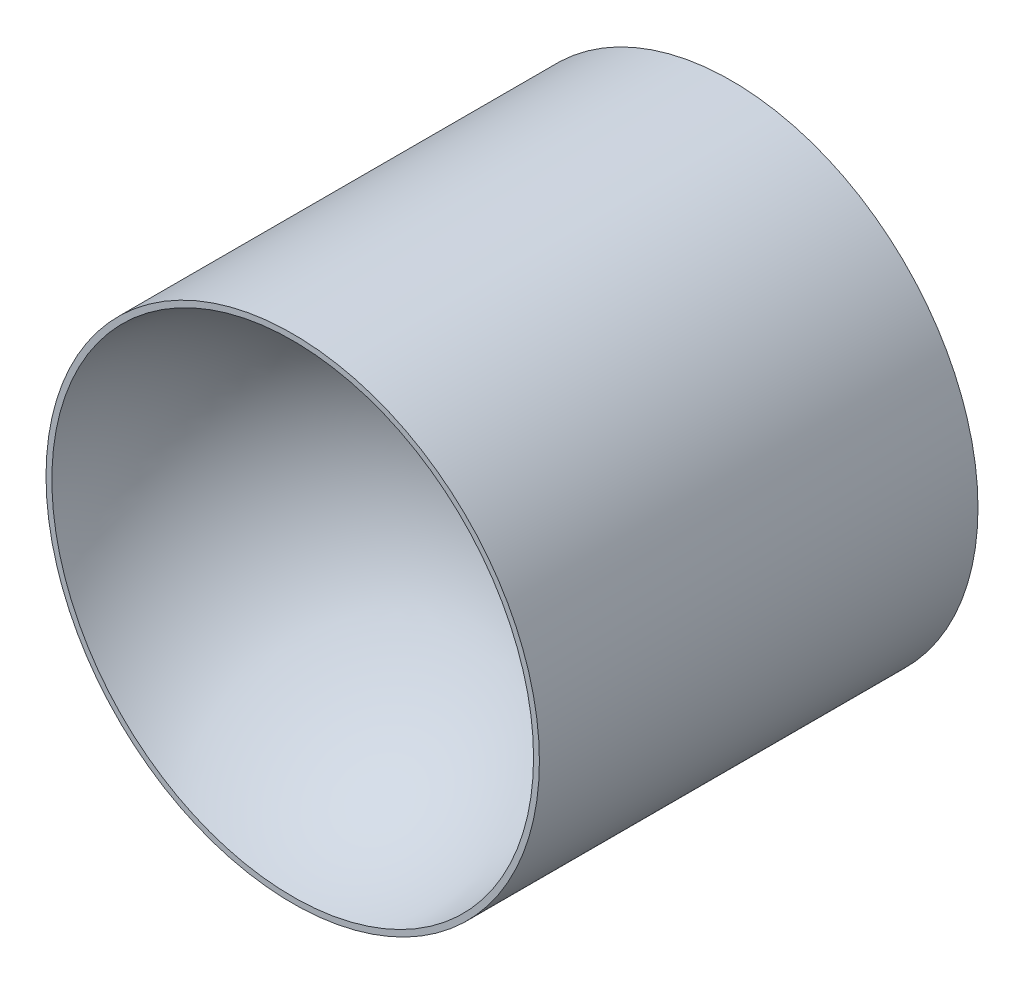
ISO-10303-21;
HEADER;
FILE_DESCRIPTION(('STEP AP214'),'2;1');
FILE_NAME('part.step','',(''),(''),'','','');
FILE_SCHEMA(('AUTOMOTIVE_DESIGN { 1 0 10303 214 1 1 1 1 }'));
ENDSEC;
DATA;
#1=APPLICATION_CONTEXT('core data for automotive mechanical design processes');
#2=APPLICATION_PROTOCOL_DEFINITION('international standard','automotive_design',2000,#1);
#3=PRODUCT_CONTEXT('',#1,'mechanical');
#4=PRODUCT('Part','Part','',(#3));
#5=PRODUCT_RELATED_PRODUCT_CATEGORY('part','',(#4));
#6=PRODUCT_DEFINITION_FORMATION('','',#4);
#7=PRODUCT_DEFINITION_CONTEXT('part definition',#1,'design');
#8=PRODUCT_DEFINITION('design','',#6,#7);
#9=PRODUCT_DEFINITION_SHAPE('','',#8);
#10=(LENGTH_UNIT() NAMED_UNIT(*) SI_UNIT(.MILLI.,.METRE.));
#11=(NAMED_UNIT(*) PLANE_ANGLE_UNIT() SI_UNIT($,.RADIAN.));
#12=(NAMED_UNIT(*) SI_UNIT($,.STERADIAN.) SOLID_ANGLE_UNIT());
#13=UNCERTAINTY_MEASURE_WITH_UNIT(LENGTH_MEASURE(1.E-05),#10,'distance_accuracy_value','');
#14=(GEOMETRIC_REPRESENTATION_CONTEXT(3) GLOBAL_UNCERTAINTY_ASSIGNED_CONTEXT((#13)) GLOBAL_UNIT_ASSIGNED_CONTEXT((#10,
#11,#12)) REPRESENTATION_CONTEXT('',''));
#15=CARTESIAN_POINT('',(0.,0.,0.));
#16=DIRECTION('',(0.,0.,1.));
#17=DIRECTION('',(1.,0.,0.));
#18=AXIS2_PLACEMENT_3D('',#15,#16,#17);
#19=CARTESIAN_POINT('',(0.,0.,74.));
#20=DIRECTION('',(0.,0.,-1.));
#21=DIRECTION('',(-1.,0.,0.));
#22=AXIS2_PLACEMENT_3D('',#19,#20,#21);
#23=CYLINDRICAL_SURFACE('',#22,36.);
#24=CARTESIAN_POINT('',(0.,0.,0.));
#25=DIRECTION('',(0.,0.,1.));
#26=DIRECTION('',(1.,0.,0.));
#27=AXIS2_PLACEMENT_3D('',#24,#25,#26);
#28=CIRCLE('',#27,36.);
#29=CARTESIAN_POINT('',(36.,0.,0.));
#30=VERTEX_POINT('',#29);
#31=EDGE_CURVE('E10',#30,#30,#28,.T.);
#32=ORIENTED_EDGE('',*,*,#31,.T.);
#33=EDGE_LOOP('',(#32));
#34=FACE_BOUND('',#33,.T.);
#35=CARTESIAN_POINT('',(0.,0.,64.));
#36=DIRECTION('',(0.,0.,1.));
#37=DIRECTION('',(1.,0.,0.));
#38=AXIS2_PLACEMENT_3D('',#35,#36,#37);
#39=CIRCLE('',#38,36.);
#40=CARTESIAN_POINT('',(36.,0.,64.));
#41=VERTEX_POINT('',#40);
#42=EDGE_CURVE('E39',#41,#41,#39,.F.);
#43=ORIENTED_EDGE('',*,*,#42,.T.);
#44=EDGE_LOOP('',(#43));
#45=FACE_BOUND('',#44,.T.);
#46=ADVANCED_FACE('F33',(#34,#45),#23,.T.);
#47=CARTESIAN_POINT('',(0.,0.,0.));
#48=DIRECTION('',(0.,0.,1.));
#49=DIRECTION('',(1.,0.,0.));
#50=AXIS2_PLACEMENT_3D('',#47,#48,#49);
#51=PLANE('',#50);
#52=CARTESIAN_POINT('',(0.,0.,0.));
#53=DIRECTION('',(0.,0.,-1.));
#54=DIRECTION('',(-1.,0.,0.));
#55=AXIS2_PLACEMENT_3D('',#52,#53,#54);
#56=CIRCLE('',#55,11.5);
#57=CARTESIAN_POINT('',(-11.5,0.,0.));
#58=VERTEX_POINT('',#57);
#59=EDGE_CURVE('E50',#58,#58,#56,.T.);
#60=ORIENTED_EDGE('',*,*,#59,.F.);
#61=EDGE_LOOP('',(#60));
#62=FACE_BOUND('',#61,.T.);
#63=ORIENTED_EDGE('',*,*,#31,.F.);
#64=EDGE_LOOP('',(#63));
#65=FACE_BOUND('',#64,.T.);
#66=ADVANCED_FACE('F65',(#62,#65),#51,.F.);
#67=CARTESIAN_POINT('',(0.,0.,64.));
#68=DIRECTION('',(0.,0.,1.));
#69=DIRECTION('',(1.,0.,0.));
#70=AXIS2_PLACEMENT_3D('',#67,#68,#69);
#71=PLANE('',#70);
#72=ORIENTED_EDGE('',*,*,#42,.F.);
#73=EDGE_LOOP('',(#72));
#74=FACE_BOUND('',#73,.T.);
#75=CARTESIAN_POINT('',(0.,0.,64.));
#76=DIRECTION('',(0.,0.,1.));
#77=DIRECTION('',(1.,0.,0.));
#78=AXIS2_PLACEMENT_3D('',#75,#76,#77);
#79=CIRCLE('',#78,35.1461235415799);
#80=CARTESIAN_POINT('',(35.1461235415799,0.,64.));
#81=VERTEX_POINT('',#80);
#82=EDGE_CURVE('E43',#81,#81,#79,.T.);
#83=ORIENTED_EDGE('',*,*,#82,.F.);
#84=EDGE_LOOP('',(#83));
#85=FACE_BOUND('',#84,.T.);
#86=ADVANCED_FACE('F68',(#74,#85),#71,.T.);
#87=CARTESIAN_POINT('',(0.,0.,69.));
#88=DIRECTION('',(1.,0.,0.));
#89=DIRECTION('',(0.,-1.,0.));
#90=AXIS2_PLACEMENT_3D('',#87,#88,#89);
#91=SPHERICAL_SURFACE('',#90,35.5);
#92=CARTESIAN_POINT('',(0.,0.,69.));
#93=DIRECTION('',(0.,0.,1.));
#94=DIRECTION('',(1.,0.,0.));
#95=AXIS2_PLACEMENT_3D('',#92,#93,#94);
#96=SPHERICAL_SURFACE('',#95,35.5);
#97=ORIENTED_EDGE('',*,*,#82,.T.);
#98=EDGE_LOOP('',(#97));
#99=FACE_BOUND('',#98,.T.);
#100=ADVANCED_FACE('F61',(#99),#96,.F.);
#101=CARTESIAN_POINT('',(0.,0.,2.5));
#102=DIRECTION('',(0.,0.,-1.));
#103=DIRECTION('',(-1.,0.,0.));
#104=AXIS2_PLACEMENT_3D('',#101,#102,#103);
#105=CYLINDRICAL_SURFACE('',#104,11.5);
#106=CARTESIAN_POINT('',(0.,0.,2.5));
#107=DIRECTION('',(0.,0.,-1.));
#108=DIRECTION('',(-1.,0.,0.));
#109=AXIS2_PLACEMENT_3D('',#106,#107,#108);
#110=CIRCLE('',#109,11.5);
#111=CARTESIAN_POINT('',(-11.5,0.,2.5));
#112=VERTEX_POINT('',#111);
#113=EDGE_CURVE('E47',#112,#112,#110,.T.);
#114=ORIENTED_EDGE('',*,*,#113,.F.);
#115=EDGE_LOOP('',(#114));
#116=FACE_BOUND('',#115,.T.);
#117=ORIENTED_EDGE('',*,*,#59,.T.);
#118=EDGE_LOOP('',(#117));
#119=FACE_BOUND('',#118,.T.);
#120=ADVANCED_FACE('F58',(#116,#119),#105,.F.);
#121=CARTESIAN_POINT('',(0.,0.,2.5));
#122=DIRECTION('',(0.,0.,-1.));
#123=DIRECTION('',(-1.,0.,0.));
#124=AXIS2_PLACEMENT_3D('',#121,#122,#123);
#125=PLANE('',#124);
#126=ORIENTED_EDGE('',*,*,#113,.T.);
#127=EDGE_LOOP('',(#126));
#128=FACE_BOUND('',#127,.T.);
#129=ADVANCED_FACE('F56',(#128),#125,.T.);
#130=CLOSED_SHELL('',(#46,#66,#86,#100,#120,#129));
#131=MANIFOLD_SOLID_BREP('B2',#130);
#132=ADVANCED_BREP_SHAPE_REPRESENTATION('',(#18,#131),#14);
#133=SHAPE_DEFINITION_REPRESENTATION(#9,#132);
ENDSEC;
END-ISO-10303-21;
